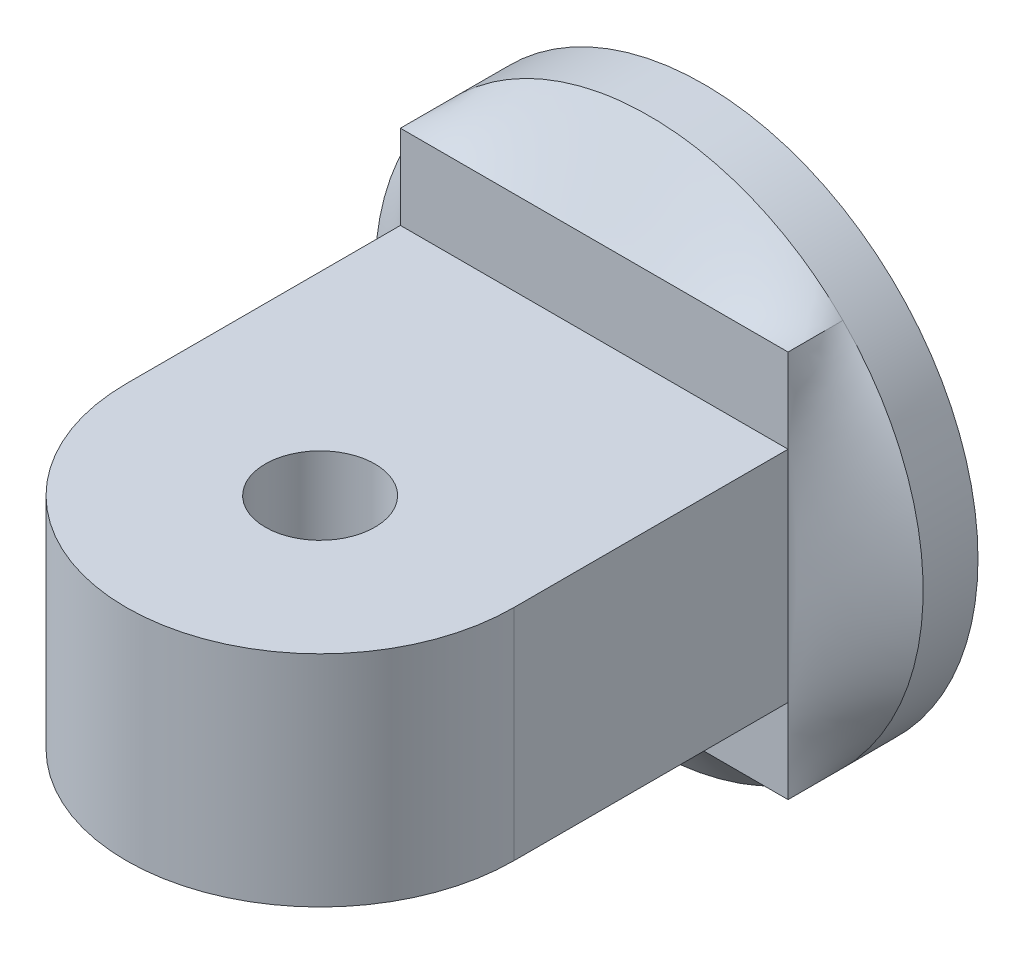
ISO-10303-21;
HEADER;
FILE_DESCRIPTION(('STEP AP214'),'2;1');
FILE_NAME('part.step','',(''),(''),'','','');
FILE_SCHEMA(('AUTOMOTIVE_DESIGN { 1 0 10303 214 1 1 1 1 }'));
ENDSEC;
DATA;
#1=APPLICATION_CONTEXT('core data for automotive mechanical design processes');
#2=APPLICATION_PROTOCOL_DEFINITION('international standard','automotive_design',2000,#1);
#3=PRODUCT_CONTEXT('',#1,'mechanical');
#4=PRODUCT('Part','Part','',(#3));
#5=PRODUCT_RELATED_PRODUCT_CATEGORY('part','',(#4));
#6=PRODUCT_DEFINITION_FORMATION('','',#4);
#7=PRODUCT_DEFINITION_CONTEXT('part definition',#1,'design');
#8=PRODUCT_DEFINITION('design','',#6,#7);
#9=PRODUCT_DEFINITION_SHAPE('','',#8);
#10=(LENGTH_UNIT() NAMED_UNIT(*) SI_UNIT(.MILLI.,.METRE.));
#11=(NAMED_UNIT(*) PLANE_ANGLE_UNIT() SI_UNIT($,.RADIAN.));
#12=(NAMED_UNIT(*) SI_UNIT($,.STERADIAN.) SOLID_ANGLE_UNIT());
#13=UNCERTAINTY_MEASURE_WITH_UNIT(LENGTH_MEASURE(1.E-05),#10,'distance_accuracy_value','');
#14=(GEOMETRIC_REPRESENTATION_CONTEXT(3) GLOBAL_UNCERTAINTY_ASSIGNED_CONTEXT((#13)) GLOBAL_UNIT_ASSIGNED_CONTEXT((#10,
#11,#12)) REPRESENTATION_CONTEXT('',''));
#15=CARTESIAN_POINT('',(0.,0.,0.));
#16=DIRECTION('',(0.,0.,1.));
#17=DIRECTION('',(1.,0.,0.));
#18=AXIS2_PLACEMENT_3D('',#15,#16,#17);
#19=CARTESIAN_POINT('',(0.,0.,20.));
#20=DIRECTION('',(0.,0.,1.));
#21=DIRECTION('',(1.,0.,0.));
#22=AXIS2_PLACEMENT_3D('',#19,#20,#21);
#23=PLANE('',#22);
#24=DIRECTION('',(-1.,0.,0.));
#25=VECTOR('',#24,1.);
#26=CARTESIAN_POINT('',(35.3553390593274,20.,20.));
#27=LINE('',#26,#25);
#28=CARTESIAN_POINT('',(35.3553390593274,20.,20.));
#29=VERTEX_POINT('',#28);
#30=CARTESIAN_POINT('',(-35.3553390593274,20.,20.));
#31=VERTEX_POINT('',#30);
#32=EDGE_CURVE('E85',#29,#31,#27,.T.);
#33=ORIENTED_EDGE('',*,*,#32,.F.);
#34=DIRECTION('',(0.,1.,0.));
#35=VECTOR('',#34,1.);
#36=CARTESIAN_POINT('',(35.3553390593274,-35.3553390593274,20.));
#37=LINE('',#36,#35);
#38=CARTESIAN_POINT('',(35.3553390593274,35.3553390593274,20.));
#39=VERTEX_POINT('',#38);
#40=EDGE_CURVE('E209',#29,#39,#37,.T.);
#41=ORIENTED_EDGE('',*,*,#40,.T.);
#42=DIRECTION('',(-1.,0.,0.));
#43=VECTOR('',#42,1.);
#44=CARTESIAN_POINT('',(35.3553390593274,35.3553390593274,20.));
#45=LINE('',#44,#43);
#46=CARTESIAN_POINT('',(-35.3553390593274,35.3553390593274,20.));
#47=VERTEX_POINT('',#46);
#48=EDGE_CURVE('E199',#39,#47,#45,.T.);
#49=ORIENTED_EDGE('',*,*,#48,.T.);
#50=DIRECTION('',(0.,-1.,0.));
#51=VECTOR('',#50,1.);
#52=CARTESIAN_POINT('',(-35.3553390593274,-35.3553390593274,20.));
#53=LINE('',#52,#51);
#54=EDGE_CURVE('E187',#47,#31,#53,.T.);
#55=ORIENTED_EDGE('',*,*,#54,.T.);
#56=EDGE_LOOP('',(#33,#41,#49,#55));
#57=FACE_BOUND('',#56,.T.);
#58=ADVANCED_FACE('F66',(#57),#23,.T.);
#59=CARTESIAN_POINT('',(0.,0.,10.));
#60=DIRECTION('',(0.,0.,-1.));
#61=DIRECTION('',(-1.,0.,0.));
#62=AXIS2_PLACEMENT_3D('',#59,#60,#61);
#63=CYLINDRICAL_SURFACE('',#62,50.);
#64=CARTESIAN_POINT('',(35.3553390593274,35.3553390593274,10.));
#65=CARTESIAN_POINT('',(33.272005725994,37.4386723926607,10.));
#66=CARTESIAN_POINT('',(30.925559549128,39.414711481806,10.));
#67=CARTESIAN_POINT('',(25.7378990207185,42.9822087452467,10.));
#68=CARTESIAN_POINT('',(22.8964197482249,44.5725118552429,10.));
#69=CARTESIAN_POINT('',(16.8213150016822,47.2016759446828,10.));
#70=CARTESIAN_POINT('',(13.5881651527707,48.2392482457469,10.));
#71=CARTESIAN_POINT('',(6.90278229276499,49.6388446697993,10.));
#72=CARTESIAN_POINT('',(3.45177968644246,50.,10.));
#73=CARTESIAN_POINT('',(-3.45177968644245,50.,10.));
#74=CARTESIAN_POINT('',(-6.90278229276498,49.6388446697993,10.));
#75=CARTESIAN_POINT('',(-13.5881651527707,48.2392482457469,10.));
#76=CARTESIAN_POINT('',(-16.8213150016822,47.2016759446828,10.));
#77=CARTESIAN_POINT('',(-22.8964197482249,44.5725118552429,10.));
#78=CARTESIAN_POINT('',(-25.7378990207185,42.9822087452468,10.));
#79=CARTESIAN_POINT('',(-30.925559549128,39.4147114818059,10.));
#80=CARTESIAN_POINT('',(-33.272005725994,37.4386723926607,10.));
#81=CARTESIAN_POINT('',(-35.3553390593274,35.3553390593274,10.));
#82=B_SPLINE_CURVE_WITH_KNOTS('',3,(#64,#65,#66,#67,#68,#69,#70,#71,#72,#73,#74,#75,#76,#77,#78,
#79,#80,#81),.UNSPECIFIED.,.F.,.F.,(4,2,2,2,2,2,2,2,4),(0.,0.125,0.25,0.375,0.5,0.625,0.75,
0.875,1.),.UNSPECIFIED.);
#83=CARTESIAN_POINT('',(35.3553390593274,35.3553390593274,10.));
#84=VERTEX_POINT('',#83);
#85=CARTESIAN_POINT('',(-35.3553390593274,35.3553390593274,10.));
#86=VERTEX_POINT('',#85);
#87=EDGE_CURVE('E12',#84,#86,#82,.T.);
#88=ORIENTED_EDGE('',*,*,#87,.F.);
#89=CARTESIAN_POINT('',(0.,0.,10.));
#90=DIRECTION('',(0.,0.,-1.));
#91=DIRECTION('',(1.,0.,0.));
#92=AXIS2_PLACEMENT_3D('',#89,#90,#91);
#93=CIRCLE('',#92,50.);
#94=CARTESIAN_POINT('',(35.3553390593274,-35.3553390593274,10.));
#95=VERTEX_POINT('',#94);
#96=EDGE_CURVE('E333',#95,#84,#93,.F.);
#97=ORIENTED_EDGE('',*,*,#96,.F.);
#98=CARTESIAN_POINT('',(0.,0.,10.));
#99=DIRECTION('',(0.,0.,1.));
#100=DIRECTION('',(1.,0.,0.));
#101=AXIS2_PLACEMENT_3D('',#98,#99,#100);
#102=CIRCLE('',#101,50.);
#103=CARTESIAN_POINT('',(-35.3553390593274,-35.3553390593274,10.));
#104=VERTEX_POINT('',#103);
#105=EDGE_CURVE('E334',#104,#95,#102,.T.);
#106=ORIENTED_EDGE('',*,*,#105,.F.);
#107=CARTESIAN_POINT('',(0.,0.,10.));
#108=DIRECTION('',(0.,0.,1.));
#109=DIRECTION('',(1.,0.,0.));
#110=AXIS2_PLACEMENT_3D('',#107,#108,#109);
#111=CIRCLE('',#110,50.);
#112=EDGE_CURVE('E330',#86,#104,#111,.T.);
#113=ORIENTED_EDGE('',*,*,#112,.F.);
#114=EDGE_LOOP('',(#88,#97,#106,#113));
#115=FACE_BOUND('',#114,.T.);
#116=CARTESIAN_POINT('',(0.,0.,0.));
#117=DIRECTION('',(0.,0.,1.));
#118=DIRECTION('',(1.,0.,0.));
#119=AXIS2_PLACEMENT_3D('',#116,#117,#118);
#120=CIRCLE('',#119,50.);
#121=CARTESIAN_POINT('',(50.,0.,0.));
#122=VERTEX_POINT('',#121);
#123=EDGE_CURVE('E78',#122,#122,#120,.T.);
#124=ORIENTED_EDGE('',*,*,#123,.T.);
#125=EDGE_LOOP('',(#124));
#126=FACE_BOUND('',#125,.T.);
#127=ADVANCED_FACE('F68',(#115,#126),#63,.T.);
#128=CARTESIAN_POINT('',(0.,0.,0.));
#129=DIRECTION('',(0.,0.,1.));
#130=DIRECTION('',(1.,0.,0.));
#131=AXIS2_PLACEMENT_3D('',#128,#129,#130);
#132=PLANE('',#131);
#133=ORIENTED_EDGE('',*,*,#123,.F.);
#134=EDGE_LOOP('',(#133));
#135=FACE_BOUND('',#134,.T.);
#136=ADVANCED_FACE('F240',(#135),#132,.F.);
#137=DIRECTION('',(1.,0.,0.));
#138=VECTOR('',#137,1.);
#139=CARTESIAN_POINT('',(35.3553390593274,-20.,20.));
#140=LINE('',#139,#138);
#141=CARTESIAN_POINT('',(-35.3553390593274,-20.,20.));
#142=VERTEX_POINT('',#141);
#143=CARTESIAN_POINT('',(35.3553390593274,-20.,20.));
#144=VERTEX_POINT('',#143);
#145=EDGE_CURVE('E93',#142,#144,#140,.T.);
#146=ORIENTED_EDGE('',*,*,#145,.F.);
#147=CARTESIAN_POINT('',(-35.3553390593274,-35.3553390593274,20.));
#148=VERTEX_POINT('',#147);
#149=EDGE_CURVE('E184',#142,#148,#53,.T.);
#150=ORIENTED_EDGE('',*,*,#149,.T.);
#151=DIRECTION('',(1.,0.,0.));
#152=VECTOR('',#151,1.);
#153=CARTESIAN_POINT('',(35.3553390593274,-35.3553390593274,20.));
#154=LINE('',#153,#152);
#155=CARTESIAN_POINT('',(35.3553390593274,-35.3553390593274,20.));
#156=VERTEX_POINT('',#155);
#157=EDGE_CURVE('E217',#148,#156,#154,.T.);
#158=ORIENTED_EDGE('',*,*,#157,.T.);
#159=EDGE_CURVE('E178',#156,#144,#37,.T.);
#160=ORIENTED_EDGE('',*,*,#159,.T.);
#161=EDGE_LOOP('',(#146,#150,#158,#160));
#162=FACE_BOUND('',#161,.T.);
#163=ADVANCED_FACE('F230',(#162),#23,.T.);
#164=CARTESIAN_POINT('',(-35.3553390593274,-35.3553390593274,10.));
#165=CARTESIAN_POINT('',(-35.3553390593274,-35.3553390593274,20.));
#166=CARTESIAN_POINT('',(-33.272005725994,-37.4386723926607,10.));
#167=CARTESIAN_POINT('',(-32.4090608043834,-35.3553390593274,20.));
#168=CARTESIAN_POINT('',(-30.925559549128,-39.414711481806,10.));
#169=CARTESIAN_POINT('',(-29.4627825494394,-35.3553390593274,20.));
#170=CARTESIAN_POINT('',(-25.7378990207185,-42.9822087452467,10.));
#171=CARTESIAN_POINT('',(-23.5702260395515,-35.3553390593274,20.));
#172=CARTESIAN_POINT('',(-22.8964197482249,-44.5725118552429,10.));
#173=CARTESIAN_POINT('',(-20.6239477846076,-35.3553390593274,20.));
#174=CARTESIAN_POINT('',(-16.8213150016822,-47.2016759446828,10.));
#175=CARTESIAN_POINT('',(-14.7313912747196,-35.3553390593274,20.));
#176=CARTESIAN_POINT('',(-13.5881651527707,-48.2392482457469,10.));
#177=CARTESIAN_POINT('',(-11.7851130197757,-35.3553390593274,20.));
#178=CARTESIAN_POINT('',(-6.90278229276499,-49.6388446697993,10.));
#179=CARTESIAN_POINT('',(-5.8925565098878,-35.3553390593274,20.));
#180=CARTESIAN_POINT('',(-3.45177968644247,-50.,10.));
#181=CARTESIAN_POINT('',(-2.94627825494385,-35.3553390593274,20.));
#182=CARTESIAN_POINT('',(3.45177968644245,-50.,10.));
#183=CARTESIAN_POINT('',(2.94627825494404,-35.3553390593274,20.));
#184=CARTESIAN_POINT('',(6.90278229276497,-49.6388446697993,10.));
#185=CARTESIAN_POINT('',(5.89255650988799,-35.3553390593274,20.));
#186=CARTESIAN_POINT('',(13.5881651527707,-48.2392482457469,10.));
#187=CARTESIAN_POINT('',(11.7851130197759,-35.3553390593274,20.));
#188=CARTESIAN_POINT('',(16.8213150016822,-47.2016759446828,10.));
#189=CARTESIAN_POINT('',(14.7313912747198,-35.3553390593274,20.));
#190=CARTESIAN_POINT('',(22.8964197482249,-44.5725118552429,10.));
#191=CARTESIAN_POINT('',(20.6239477846077,-35.3553390593274,20.));
#192=CARTESIAN_POINT('',(25.7378990207185,-42.9822087452467,10.));
#193=CARTESIAN_POINT('',(23.5702260395516,-35.3553390593274,20.));
#194=CARTESIAN_POINT('',(30.925559549128,-39.414711481806,10.));
#195=CARTESIAN_POINT('',(29.4627825494395,-35.3553390593274,20.));
#196=CARTESIAN_POINT('',(33.272005725994,-37.4386723926607,10.));
#197=CARTESIAN_POINT('',(32.4090608043835,-35.3553390593274,20.));
#198=CARTESIAN_POINT('',(35.3553390593274,-35.3553390593274,10.));
#199=CARTESIAN_POINT('',(35.3553390593274,-35.3553390593274,20.));
#200=B_SPLINE_SURFACE_WITH_KNOTS('',3,1,((#164,#165),(#166,#167),(#168,#169),(#170,#171),(#172,
#173),(#174,#175),(#176,#177),(#178,#179),(#180,#181),(#182,#183),(#184,#185),(#186,#187),(#188,
#189),(#190,#191),(#192,#193),(#194,#195),(#196,#197),(#198,#199)),.UNSPECIFIED.,.F.,.F.,.F.,(4,
2,2,2,2,2,2,2,4),(2,2),(0.,0.125,0.25,0.375,0.5,0.625,0.75,0.875,1.),(0.,1.),.UNSPECIFIED.);
#201=DIRECTION('',(0.,0.,1.));
#202=VECTOR('',#201,1.);
#203=CARTESIAN_POINT('',(35.3553390593274,-35.3553390593274,15.));
#204=LINE('',#203,#202);
#205=EDGE_CURVE('E338',#95,#156,#204,.T.);
#206=DIRECTION('',(0.,0.,-1.));
#207=VECTOR('',#206,1.);
#208=CARTESIAN_POINT('',(-35.3553390593274,-35.3553390593274,15.));
#209=LINE('',#208,#207);
#210=EDGE_CURVE('E220',#148,#104,#209,.T.);
#211=ORIENTED_EDGE('',*,*,#105,.T.);
#212=ORIENTED_EDGE('',*,*,#205,.T.);
#213=ORIENTED_EDGE('',*,*,#157,.F.);
#214=ORIENTED_EDGE('',*,*,#210,.T.);
#215=EDGE_LOOP('',(#211,#212,#213,#214));
#216=FACE_BOUND('',#215,.T.);
#217=ADVANCED_FACE('F239',(#216),#200,.T.);
#218=CARTESIAN_POINT('',(35.3553390593274,-35.3553390593274,10.));
#219=CARTESIAN_POINT('',(35.3553390593274,-35.3553390593274,20.));
#220=CARTESIAN_POINT('',(37.4386723926607,-33.272005725994,10.));
#221=CARTESIAN_POINT('',(35.3553390593274,-32.4090608043834,20.));
#222=CARTESIAN_POINT('',(39.414711481806,-30.925559549128,10.));
#223=CARTESIAN_POINT('',(35.3553390593274,-29.4627825494394,20.));
#224=CARTESIAN_POINT('',(42.9822087452467,-25.7378990207185,10.));
#225=CARTESIAN_POINT('',(35.3553390593274,-23.5702260395515,20.));
#226=CARTESIAN_POINT('',(44.5725118552429,-22.8964197482249,10.));
#227=CARTESIAN_POINT('',(35.3553390593274,-20.6239477846076,20.));
#228=CARTESIAN_POINT('',(47.2016759446828,-16.8213150016822,10.));
#229=CARTESIAN_POINT('',(35.3553390593274,-14.7313912747197,20.));
#230=CARTESIAN_POINT('',(48.2392482457469,-13.5881651527707,10.));
#231=CARTESIAN_POINT('',(35.3553390593274,-11.7851130197757,20.));
#232=CARTESIAN_POINT('',(49.6388446697993,-6.90278229276499,10.));
#233=CARTESIAN_POINT('',(35.3553390593274,-5.89255650988783,20.));
#234=CARTESIAN_POINT('',(50.,-3.45177968644246,10.));
#235=CARTESIAN_POINT('',(35.3553390593274,-2.94627825494388,20.));
#236=CARTESIAN_POINT('',(50.,3.45177968644246,10.));
#237=CARTESIAN_POINT('',(35.3553390593274,2.94627825494402,20.));
#238=CARTESIAN_POINT('',(49.6388446697993,6.90278229276498,10.));
#239=CARTESIAN_POINT('',(35.3553390593274,5.89255650988796,20.));
#240=CARTESIAN_POINT('',(48.2392482457469,13.5881651527707,10.));
#241=CARTESIAN_POINT('',(35.3553390593274,11.7851130197759,20.));
#242=CARTESIAN_POINT('',(47.2016759446828,16.8213150016822,10.));
#243=CARTESIAN_POINT('',(35.3553390593274,14.7313912747198,20.));
#244=CARTESIAN_POINT('',(44.5725118552429,22.8964197482249,10.));
#245=CARTESIAN_POINT('',(35.3553390593274,20.6239477846077,20.));
#246=CARTESIAN_POINT('',(42.9822087452468,25.7378990207185,10.));
#247=CARTESIAN_POINT('',(35.3553390593274,23.5702260395516,20.));
#248=CARTESIAN_POINT('',(39.4147114818059,30.925559549128,10.));
#249=CARTESIAN_POINT('',(35.3553390593274,29.4627825494395,20.));
#250=CARTESIAN_POINT('',(37.4386723926607,33.2720057259941,10.));
#251=CARTESIAN_POINT('',(35.3553390593274,32.4090608043835,20.));
#252=CARTESIAN_POINT('',(35.3553390593274,35.3553390593274,10.));
#253=CARTESIAN_POINT('',(35.3553390593274,35.3553390593274,20.));
#254=B_SPLINE_SURFACE_WITH_KNOTS('',3,1,((#218,#219),(#220,#221),(#222,#223),(#224,#225),(#226,
#227),(#228,#229),(#230,#231),(#232,#233),(#234,#235),(#236,#237),(#238,#239),(#240,#241),(#242,
#243),(#244,#245),(#246,#247),(#248,#249),(#250,#251),(#252,#253)),.UNSPECIFIED.,.F.,.F.,.F.,(4,
2,2,2,2,2,2,2,4),(2,2),(0.,0.125,0.25,0.375,0.5,0.625,0.75,0.875,1.),(0.,1.),.UNSPECIFIED.);
#255=DIRECTION('',(0.,0.,1.));
#256=VECTOR('',#255,1.);
#257=CARTESIAN_POINT('',(35.3553390593274,35.3553390593274,15.));
#258=LINE('',#257,#256);
#259=EDGE_CURVE('E337',#84,#39,#258,.T.);
#260=CARTESIAN_POINT('',(35.3553390593274,35.3553390593274,20.));
#261=CARTESIAN_POINT('',(35.3553390593274,32.4090608043835,20.));
#262=CARTESIAN_POINT('',(35.3553390593274,29.4627825494395,20.));
#263=CARTESIAN_POINT('',(35.3553390593274,23.5702260395516,20.));
#264=CARTESIAN_POINT('',(35.3553390593274,20.6239477846077,20.));
#265=CARTESIAN_POINT('',(35.3553390593274,14.7313912747198,20.));
#266=CARTESIAN_POINT('',(35.3553390593274,11.7851130197759,20.));
#267=CARTESIAN_POINT('',(35.3553390593274,5.89255650988796,20.));
#268=CARTESIAN_POINT('',(35.3553390593274,2.94627825494402,20.));
#269=CARTESIAN_POINT('',(35.3553390593274,-2.94627825494388,20.));
#270=CARTESIAN_POINT('',(35.3553390593274,-5.89255650988783,20.));
#271=CARTESIAN_POINT('',(35.3553390593274,-11.7851130197757,20.));
#272=CARTESIAN_POINT('',(35.3553390593274,-14.7313912747197,20.));
#273=CARTESIAN_POINT('',(35.3553390593274,-20.6239477846076,20.));
#274=CARTESIAN_POINT('',(35.3553390593274,-23.5702260395515,20.));
#275=CARTESIAN_POINT('',(35.3553390593274,-29.4627825494394,20.));
#276=CARTESIAN_POINT('',(35.3553390593274,-32.4090608043834,20.));
#277=CARTESIAN_POINT('',(35.3553390593274,-35.3553390593274,20.));
#278=B_SPLINE_CURVE_WITH_KNOTS('',3,(#260,#261,#262,#263,#264,#265,#266,#267,#268,#269,#270,
#271,#272,#273,#274,#275,#276,#277),.UNSPECIFIED.,.F.,.F.,(4,2,2,2,2,2,2,2,4),(0.,0.125,0.25,
0.375,0.5,0.625,0.75,0.875,1.),.UNSPECIFIED.);
#279=EDGE_CURVE('E177',#144,#29,#278,.F.);
#280=ORIENTED_EDGE('',*,*,#96,.T.);
#281=ORIENTED_EDGE('',*,*,#259,.T.);
#282=ORIENTED_EDGE('',*,*,#40,.F.);
#283=ORIENTED_EDGE('',*,*,#279,.F.);
#284=ORIENTED_EDGE('',*,*,#159,.F.);
#285=ORIENTED_EDGE('',*,*,#205,.F.);
#286=EDGE_LOOP('',(#280,#281,#282,#283,#284,#285));
#287=FACE_BOUND('',#286,.T.);
#288=ADVANCED_FACE('F305',(#287),#254,.T.);
#289=CARTESIAN_POINT('',(-35.3553390593274,35.3553390593274,10.));
#290=CARTESIAN_POINT('',(-35.3553390593274,35.3553390593274,20.));
#291=CARTESIAN_POINT('',(-37.4386723926607,33.272005725994,10.));
#292=CARTESIAN_POINT('',(-35.3553390593274,32.4090608043834,20.));
#293=CARTESIAN_POINT('',(-39.414711481806,30.925559549128,10.));
#294=CARTESIAN_POINT('',(-35.3553390593274,29.4627825494395,20.));
#295=CARTESIAN_POINT('',(-42.9822087452467,25.7378990207185,10.));
#296=CARTESIAN_POINT('',(-35.3553390593274,23.5702260395516,20.));
#297=CARTESIAN_POINT('',(-44.5725118552429,22.8964197482249,10.));
#298=CARTESIAN_POINT('',(-35.3553390593274,20.6239477846076,20.));
#299=CARTESIAN_POINT('',(-47.2016759446828,16.8213150016822,10.));
#300=CARTESIAN_POINT('',(-35.3553390593274,14.7313912747197,20.));
#301=CARTESIAN_POINT('',(-48.2392482457469,13.5881651527707,10.));
#302=CARTESIAN_POINT('',(-35.3553390593274,11.7851130197758,20.));
#303=CARTESIAN_POINT('',(-49.6388446697993,6.90278229276498,10.));
#304=CARTESIAN_POINT('',(-35.3553390593274,5.89255650988786,20.));
#305=CARTESIAN_POINT('',(-50.,3.45177968644246,10.));
#306=CARTESIAN_POINT('',(-35.3553390593274,2.94627825494391,20.));
#307=CARTESIAN_POINT('',(-50.,-3.45177968644246,10.));
#308=CARTESIAN_POINT('',(-35.3553390593274,-2.94627825494398,20.));
#309=CARTESIAN_POINT('',(-49.6388446697993,-6.90278229276498,10.));
#310=CARTESIAN_POINT('',(-35.3553390593274,-5.89255650988793,20.));
#311=CARTESIAN_POINT('',(-48.2392482457469,-13.5881651527707,10.));
#312=CARTESIAN_POINT('',(-35.3553390593274,-11.7851130197758,20.));
#313=CARTESIAN_POINT('',(-47.2016759446828,-16.8213150016822,10.));
#314=CARTESIAN_POINT('',(-35.3553390593274,-14.7313912747198,20.));
#315=CARTESIAN_POINT('',(-44.5725118552429,-22.8964197482249,10.));
#316=CARTESIAN_POINT('',(-35.3553390593274,-20.6239477846077,20.));
#317=CARTESIAN_POINT('',(-42.9822087452468,-25.7378990207185,10.));
#318=CARTESIAN_POINT('',(-35.3553390593274,-23.5702260395516,20.));
#319=CARTESIAN_POINT('',(-39.4147114818059,-30.925559549128,10.));
#320=CARTESIAN_POINT('',(-35.3553390593274,-29.4627825494395,20.));
#321=CARTESIAN_POINT('',(-37.4386723926607,-33.272005725994,10.));
#322=CARTESIAN_POINT('',(-35.3553390593274,-32.4090608043834,20.));
#323=CARTESIAN_POINT('',(-35.3553390593274,-35.3553390593274,10.));
#324=CARTESIAN_POINT('',(-35.3553390593274,-35.3553390593274,20.));
#325=B_SPLINE_SURFACE_WITH_KNOTS('',3,1,((#289,#290),(#291,#292),(#293,#294),(#295,#296),(#297,
#298),(#299,#300),(#301,#302),(#303,#304),(#305,#306),(#307,#308),(#309,#310),(#311,#312),(#313,
#314),(#315,#316),(#317,#318),(#319,#320),(#321,#322),(#323,#324)),.UNSPECIFIED.,.F.,.F.,.F.,(4,
2,2,2,2,2,2,2,4),(2,2),(0.,0.125,0.25,0.375,0.5,0.625,0.75,0.875,1.),(0.,1.),.UNSPECIFIED.);
#326=CARTESIAN_POINT('',(-35.3553390593274,-35.3553390593274,20.));
#327=CARTESIAN_POINT('',(-35.3553390593274,-32.4090608043834,20.));
#328=CARTESIAN_POINT('',(-35.3553390593274,-29.4627825494395,20.));
#329=CARTESIAN_POINT('',(-35.3553390593274,-23.5702260395516,20.));
#330=CARTESIAN_POINT('',(-35.3553390593274,-20.6239477846077,20.));
#331=CARTESIAN_POINT('',(-35.3553390593274,-14.7313912747198,20.));
#332=CARTESIAN_POINT('',(-35.3553390593274,-11.7851130197758,20.));
#333=CARTESIAN_POINT('',(-35.3553390593274,-5.89255650988793,20.));
#334=CARTESIAN_POINT('',(-35.3553390593274,-2.94627825494398,20.));
#335=CARTESIAN_POINT('',(-35.3553390593274,2.94627825494391,20.));
#336=CARTESIAN_POINT('',(-35.3553390593274,5.89255650988786,20.));
#337=CARTESIAN_POINT('',(-35.3553390593274,11.7851130197758,20.));
#338=CARTESIAN_POINT('',(-35.3553390593274,14.7313912747197,20.));
#339=CARTESIAN_POINT('',(-35.3553390593274,20.6239477846076,20.));
#340=CARTESIAN_POINT('',(-35.3553390593274,23.5702260395516,20.));
#341=CARTESIAN_POINT('',(-35.3553390593274,29.4627825494395,20.));
#342=CARTESIAN_POINT('',(-35.3553390593274,32.4090608043834,20.));
#343=CARTESIAN_POINT('',(-35.3553390593274,35.3553390593274,20.));
#344=B_SPLINE_CURVE_WITH_KNOTS('',3,(#326,#327,#328,#329,#330,#331,#332,#333,#334,#335,#336,
#337,#338,#339,#340,#341,#342,#343),.UNSPECIFIED.,.F.,.F.,(4,2,2,2,2,2,2,2,4),(0.,0.125,0.25,
0.375,0.5,0.625,0.75,0.875,1.),.UNSPECIFIED.);
#345=EDGE_CURVE('E163',#31,#142,#344,.F.);
#346=DIRECTION('',(0.,0.,1.));
#347=VECTOR('',#346,1.);
#348=CARTESIAN_POINT('',(-35.3553390593274,35.3553390593274,15.));
#349=LINE('',#348,#347);
#350=EDGE_CURVE('E332',#86,#47,#349,.T.);
#351=ORIENTED_EDGE('',*,*,#112,.T.);
#352=ORIENTED_EDGE('',*,*,#210,.F.);
#353=ORIENTED_EDGE('',*,*,#149,.F.);
#354=ORIENTED_EDGE('',*,*,#345,.F.);
#355=ORIENTED_EDGE('',*,*,#54,.F.);
#356=ORIENTED_EDGE('',*,*,#350,.F.);
#357=EDGE_LOOP('',(#351,#352,#353,#354,#355,#356));
#358=FACE_BOUND('',#357,.T.);
#359=ADVANCED_FACE('F293',(#358),#325,.T.);
#360=CARTESIAN_POINT('',(35.3553390593274,35.3553390593274,10.));
#361=CARTESIAN_POINT('',(35.3553390593274,35.3553390593274,20.));
#362=CARTESIAN_POINT('',(33.272005725994,37.4386723926607,10.));
#363=CARTESIAN_POINT('',(32.4090608043834,35.3553390593274,20.));
#364=CARTESIAN_POINT('',(30.925559549128,39.414711481806,10.));
#365=CARTESIAN_POINT('',(29.4627825494395,35.3553390593274,20.));
#366=CARTESIAN_POINT('',(25.7378990207185,42.9822087452467,10.));
#367=CARTESIAN_POINT('',(23.5702260395516,35.3553390593274,20.));
#368=CARTESIAN_POINT('',(22.8964197482249,44.5725118552429,10.));
#369=CARTESIAN_POINT('',(20.6239477846076,35.3553390593274,20.));
#370=CARTESIAN_POINT('',(16.8213150016822,47.2016759446828,10.));
#371=CARTESIAN_POINT('',(14.7313912747197,35.3553390593274,20.));
#372=CARTESIAN_POINT('',(13.5881651527707,48.2392482457469,10.));
#373=CARTESIAN_POINT('',(11.7851130197757,35.3553390593274,20.));
#374=CARTESIAN_POINT('',(6.90278229276499,49.6388446697993,10.));
#375=CARTESIAN_POINT('',(5.89255650988785,35.3553390593274,20.));
#376=CARTESIAN_POINT('',(3.45177968644246,50.,10.));
#377=CARTESIAN_POINT('',(2.9462782549439,35.3553390593274,20.));
#378=CARTESIAN_POINT('',(-3.45177968644245,50.,10.));
#379=CARTESIAN_POINT('',(-2.94627825494399,35.3553390593274,20.));
#380=CARTESIAN_POINT('',(-6.90278229276498,49.6388446697993,10.));
#381=CARTESIAN_POINT('',(-5.89255650988794,35.3553390593274,20.));
#382=CARTESIAN_POINT('',(-13.5881651527707,48.2392482457469,10.));
#383=CARTESIAN_POINT('',(-11.7851130197758,35.3553390593274,20.));
#384=CARTESIAN_POINT('',(-16.8213150016822,47.2016759446828,10.));
#385=CARTESIAN_POINT('',(-14.7313912747198,35.3553390593274,20.));
#386=CARTESIAN_POINT('',(-22.8964197482249,44.5725118552429,10.));
#387=CARTESIAN_POINT('',(-20.6239477846077,35.3553390593274,20.));
#388=CARTESIAN_POINT('',(-25.7378990207185,42.9822087452468,10.));
#389=CARTESIAN_POINT('',(-23.5702260395516,35.3553390593274,20.));
#390=CARTESIAN_POINT('',(-30.925559549128,39.4147114818059,10.));
#391=CARTESIAN_POINT('',(-29.4627825494395,35.3553390593274,20.));
#392=CARTESIAN_POINT('',(-33.272005725994,37.4386723926607,10.));
#393=CARTESIAN_POINT('',(-32.4090608043834,35.3553390593274,20.));
#394=CARTESIAN_POINT('',(-35.3553390593274,35.3553390593274,10.));
#395=CARTESIAN_POINT('',(-35.3553390593274,35.3553390593274,20.));
#396=B_SPLINE_SURFACE_WITH_KNOTS('',3,1,((#360,#361),(#362,#363),(#364,#365),(#366,#367),(#368,
#369),(#370,#371),(#372,#373),(#374,#375),(#376,#377),(#378,#379),(#380,#381),(#382,#383),(#384,
#385),(#386,#387),(#388,#389),(#390,#391),(#392,#393),(#394,#395)),.UNSPECIFIED.,.F.,.F.,.F.,(4,
2,2,2,2,2,2,2,4),(2,2),(0.,0.125,0.25,0.375,0.5,0.625,0.75,0.875,1.),(0.,1.),.UNSPECIFIED.);
#397=ORIENTED_EDGE('',*,*,#87,.T.);
#398=ORIENTED_EDGE('',*,*,#350,.T.);
#399=ORIENTED_EDGE('',*,*,#48,.F.);
#400=ORIENTED_EDGE('',*,*,#259,.F.);
#401=EDGE_LOOP('',(#397,#398,#399,#400));
#402=FACE_BOUND('',#401,.T.);
#403=ADVANCED_FACE('F304',(#402),#396,.T.);
#404=CARTESIAN_POINT('',(-35.3553390593274,-20.,70.));
#405=DIRECTION('',(1.,0.,0.));
#406=DIRECTION('',(0.,0.,-1.));
#407=AXIS2_PLACEMENT_3D('',#404,#405,#406);
#408=PLANE('',#407);
#409=ORIENTED_EDGE('',*,*,#345,.T.);
#410=DIRECTION('',(0.,0.,-1.));
#411=VECTOR('',#410,1.);
#412=CARTESIAN_POINT('',(-35.3553390593274,-20.,70.));
#413=LINE('',#412,#411);
#414=CARTESIAN_POINT('',(-35.3553390593274,-20.,70.));
#415=VERTEX_POINT('',#414);
#416=EDGE_CURVE('E155',#415,#142,#413,.T.);
#417=ORIENTED_EDGE('',*,*,#416,.F.);
#418=DIRECTION('',(0.,-1.,0.));
#419=VECTOR('',#418,1.);
#420=CARTESIAN_POINT('',(-35.3553390593274,-20.,70.));
#421=LINE('',#420,#419);
#422=CARTESIAN_POINT('',(-35.3553390593274,20.,70.));
#423=VERTEX_POINT('',#422);
#424=EDGE_CURVE('E148',#423,#415,#421,.T.);
#425=ORIENTED_EDGE('',*,*,#424,.F.);
#426=DIRECTION('',(0.,0.,-1.));
#427=VECTOR('',#426,1.);
#428=CARTESIAN_POINT('',(-35.3553390593274,20.,70.));
#429=LINE('',#428,#427);
#430=EDGE_CURVE('E147',#423,#31,#429,.T.);
#431=ORIENTED_EDGE('',*,*,#430,.T.);
#432=EDGE_LOOP('',(#409,#417,#425,#431));
#433=FACE_BOUND('',#432,.T.);
#434=ADVANCED_FACE('F241',(#433),#408,.F.);
#435=CARTESIAN_POINT('',(35.3553390593274,-20.,70.));
#436=DIRECTION('',(0.,1.,0.));
#437=DIRECTION('',(0.,0.,1.));
#438=AXIS2_PLACEMENT_3D('',#435,#436,#437);
#439=PLANE('',#438);
#440=CARTESIAN_POINT('',(0.,-20.,70.));
#441=DIRECTION('',(0.,1.,0.));
#442=DIRECTION('',(0.,0.,1.));
#443=AXIS2_PLACEMENT_3D('',#440,#441,#442);
#444=CIRCLE('',#443,10.);
#445=CARTESIAN_POINT('',(0.,-20.,80.));
#446=VERTEX_POINT('',#445);
#447=EDGE_CURVE('E161',#446,#446,#444,.F.);
#448=ORIENTED_EDGE('',*,*,#447,.F.);
#449=EDGE_LOOP('',(#448));
#450=FACE_BOUND('',#449,.T.);
#451=ORIENTED_EDGE('',*,*,#145,.T.);
#452=DIRECTION('',(0.,0.,-1.));
#453=VECTOR('',#452,1.);
#454=CARTESIAN_POINT('',(35.3553390593274,-20.,70.));
#455=LINE('',#454,#453);
#456=CARTESIAN_POINT('',(35.3553390593274,-20.,70.));
#457=VERTEX_POINT('',#456);
#458=EDGE_CURVE('E140',#457,#144,#455,.T.);
#459=ORIENTED_EDGE('',*,*,#458,.F.);
#460=CARTESIAN_POINT('',(0.,-20.,70.));
#461=DIRECTION('',(0.,1.,0.));
#462=DIRECTION('',(0.,0.,1.));
#463=AXIS2_PLACEMENT_3D('',#460,#461,#462);
#464=CIRCLE('',#463,35.3553390593274);
#465=EDGE_CURVE('E154',#457,#415,#464,.F.);
#466=ORIENTED_EDGE('',*,*,#465,.T.);
#467=ORIENTED_EDGE('',*,*,#416,.T.);
#468=EDGE_LOOP('',(#451,#459,#466,#467));
#469=FACE_BOUND('',#468,.T.);
#470=ADVANCED_FACE('F152',(#450,#469),#439,.F.);
#471=CARTESIAN_POINT('',(35.3553390593274,-20.,70.));
#472=DIRECTION('',(-1.,0.,0.));
#473=DIRECTION('',(0.,0.,1.));
#474=AXIS2_PLACEMENT_3D('',#471,#472,#473);
#475=PLANE('',#474);
#476=ORIENTED_EDGE('',*,*,#279,.T.);
#477=DIRECTION('',(0.,0.,-1.));
#478=VECTOR('',#477,1.);
#479=CARTESIAN_POINT('',(35.3553390593274,20.,70.));
#480=LINE('',#479,#478);
#481=CARTESIAN_POINT('',(35.3553390593274,20.,70.));
#482=VERTEX_POINT('',#481);
#483=EDGE_CURVE('E142',#482,#29,#480,.T.);
#484=ORIENTED_EDGE('',*,*,#483,.F.);
#485=DIRECTION('',(0.,1.,0.));
#486=VECTOR('',#485,1.);
#487=CARTESIAN_POINT('',(35.3553390593274,-20.,70.));
#488=LINE('',#487,#486);
#489=EDGE_CURVE('E136',#457,#482,#488,.T.);
#490=ORIENTED_EDGE('',*,*,#489,.F.);
#491=ORIENTED_EDGE('',*,*,#458,.T.);
#492=EDGE_LOOP('',(#476,#484,#490,#491));
#493=FACE_BOUND('',#492,.T.);
#494=ADVANCED_FACE('F139',(#493),#475,.F.);
#495=CARTESIAN_POINT('',(35.3553390593274,20.,70.));
#496=DIRECTION('',(0.,-1.,0.));
#497=DIRECTION('',(0.,0.,-1.));
#498=AXIS2_PLACEMENT_3D('',#495,#496,#497);
#499=PLANE('',#498);
#500=CARTESIAN_POINT('',(0.,20.,70.));
#501=DIRECTION('',(0.,1.,0.));
#502=DIRECTION('',(0.,0.,1.));
#503=AXIS2_PLACEMENT_3D('',#500,#501,#502);
#504=CIRCLE('',#503,10.);
#505=CARTESIAN_POINT('',(0.,20.,80.));
#506=VERTEX_POINT('',#505);
#507=EDGE_CURVE('E166',#506,#506,#504,.T.);
#508=ORIENTED_EDGE('',*,*,#507,.F.);
#509=EDGE_LOOP('',(#508));
#510=FACE_BOUND('',#509,.T.);
#511=ORIENTED_EDGE('',*,*,#32,.T.);
#512=ORIENTED_EDGE('',*,*,#430,.F.);
#513=CARTESIAN_POINT('',(0.,20.,70.));
#514=DIRECTION('',(0.,-1.,0.));
#515=DIRECTION('',(0.,0.,-1.));
#516=AXIS2_PLACEMENT_3D('',#513,#514,#515);
#517=CIRCLE('',#516,35.3553390593274);
#518=EDGE_CURVE('E160',#482,#423,#517,.T.);
#519=ORIENTED_EDGE('',*,*,#518,.F.);
#520=ORIENTED_EDGE('',*,*,#483,.T.);
#521=EDGE_LOOP('',(#511,#512,#519,#520));
#522=FACE_BOUND('',#521,.T.);
#523=ADVANCED_FACE('F406',(#510,#522),#499,.F.);
#524=CARTESIAN_POINT('',(0.,99.0569415042095,70.));
#525=DIRECTION('',(0.,-1.,0.));
#526=DIRECTION('',(0.,0.,-1.));
#527=AXIS2_PLACEMENT_3D('',#524,#525,#526);
#528=CYLINDRICAL_SURFACE('',#527,35.3553390593274);
#529=ORIENTED_EDGE('',*,*,#489,.T.);
#530=ORIENTED_EDGE('',*,*,#518,.T.);
#531=ORIENTED_EDGE('',*,*,#424,.T.);
#532=ORIENTED_EDGE('',*,*,#465,.F.);
#533=EDGE_LOOP('',(#529,#530,#531,#532));
#534=FACE_BOUND('',#533,.T.);
#535=ADVANCED_FACE('F158',(#534),#528,.T.);
#536=CARTESIAN_POINT('',(0.,-48.2842712474619,70.));
#537=DIRECTION('',(0.,1.,0.));
#538=DIRECTION('',(0.,0.,1.));
#539=AXIS2_PLACEMENT_3D('',#536,#537,#538);
#540=CYLINDRICAL_SURFACE('',#539,10.);
#541=ORIENTED_EDGE('',*,*,#447,.T.);
#542=EDGE_LOOP('',(#541));
#543=FACE_BOUND('',#542,.T.);
#544=ORIENTED_EDGE('',*,*,#507,.T.);
#545=EDGE_LOOP('',(#544));
#546=FACE_BOUND('',#545,.T.);
#547=ADVANCED_FACE('F414',(#543,#546),#540,.F.);
#548=CLOSED_SHELL('',(#58,#127,#136,#163,#217,#288,#359,#403,#434,#470,#494,#523,#535,#547));
#549=MANIFOLD_SOLID_BREP('B2',#548);
#550=ADVANCED_BREP_SHAPE_REPRESENTATION('',(#18,#549),#14);
#551=SHAPE_DEFINITION_REPRESENTATION(#9,#550);
ENDSEC;
END-ISO-10303-21;
